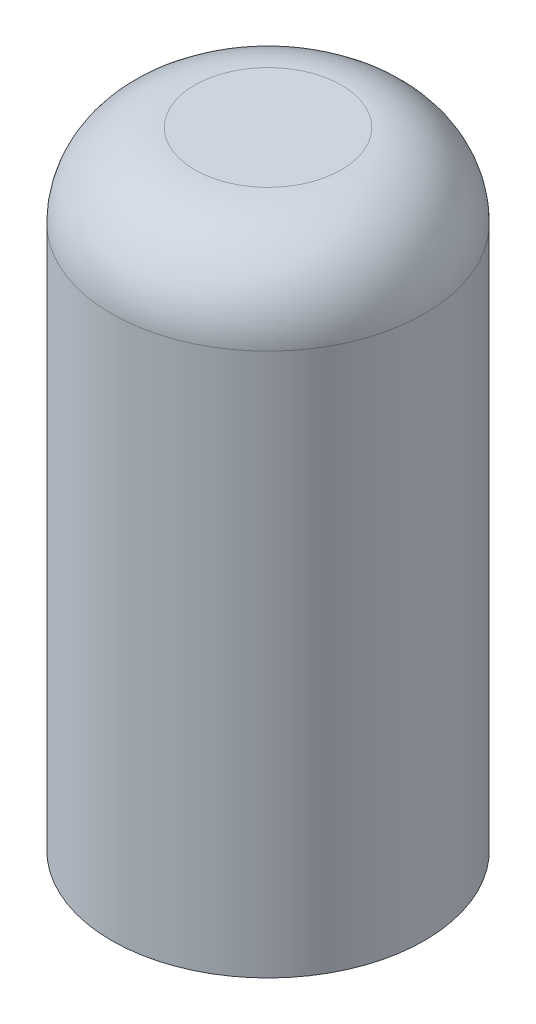
ISO-10303-21;
HEADER;
FILE_DESCRIPTION(('STEP AP214'),'2;1');
FILE_NAME('part.step','',(''),(''),'','','');
FILE_SCHEMA(('AUTOMOTIVE_DESIGN { 1 0 10303 214 1 1 1 1 }'));
ENDSEC;
DATA;
#1=APPLICATION_CONTEXT('core data for automotive mechanical design processes');
#2=APPLICATION_PROTOCOL_DEFINITION('international standard','automotive_design',2000,#1);
#3=PRODUCT_CONTEXT('',#1,'mechanical');
#4=PRODUCT('Part','Part','',(#3));
#5=PRODUCT_RELATED_PRODUCT_CATEGORY('part','',(#4));
#6=PRODUCT_DEFINITION_FORMATION('','',#4);
#7=PRODUCT_DEFINITION_CONTEXT('part definition',#1,'design');
#8=PRODUCT_DEFINITION('design','',#6,#7);
#9=PRODUCT_DEFINITION_SHAPE('','',#8);
#10=(LENGTH_UNIT() NAMED_UNIT(*) SI_UNIT(.MILLI.,.METRE.));
#11=(NAMED_UNIT(*) PLANE_ANGLE_UNIT() SI_UNIT($,.RADIAN.));
#12=(NAMED_UNIT(*) SI_UNIT($,.STERADIAN.) SOLID_ANGLE_UNIT());
#13=UNCERTAINTY_MEASURE_WITH_UNIT(LENGTH_MEASURE(1.E-05),#10,'distance_accuracy_value','');
#14=(GEOMETRIC_REPRESENTATION_CONTEXT(3) GLOBAL_UNCERTAINTY_ASSIGNED_CONTEXT((#13)) GLOBAL_UNIT_ASSIGNED_CONTEXT((#10,
#11,#12)) REPRESENTATION_CONTEXT('',''));
#15=CARTESIAN_POINT('',(0.,0.,0.));
#16=DIRECTION('',(0.,0.,1.));
#17=DIRECTION('',(1.,0.,0.));
#18=AXIS2_PLACEMENT_3D('',#15,#16,#17);
#19=CARTESIAN_POINT('',(0.,226.,0.));
#20=DIRECTION('',(0.,-1.,0.));
#21=DIRECTION('',(0.,0.,-1.));
#22=AXIS2_PLACEMENT_3D('',#19,#20,#21);
#23=CYLINDRICAL_SURFACE('',#22,56.5);
#24=CARTESIAN_POINT('',(0.,196.,0.));
#25=DIRECTION('',(0.,1.,0.));
#26=DIRECTION('',(0.,0.,1.));
#27=AXIS2_PLACEMENT_3D('',#24,#25,#26);
#28=CIRCLE('',#27,56.5);
#29=CARTESIAN_POINT('',(0.,196.,56.5));
#30=VERTEX_POINT('',#29);
#31=EDGE_CURVE('E10',#30,#30,#28,.F.);
#32=ORIENTED_EDGE('',*,*,#31,.T.);
#33=EDGE_LOOP('',(#32));
#34=FACE_BOUND('',#33,.T.);
#35=CARTESIAN_POINT('',(0.,0.,0.));
#36=DIRECTION('',(0.,1.,0.));
#37=DIRECTION('',(0.,0.,1.));
#38=AXIS2_PLACEMENT_3D('',#35,#36,#37);
#39=CIRCLE('',#38,56.5);
#40=CARTESIAN_POINT('',(0.,0.,56.5));
#41=VERTEX_POINT('',#40);
#42=EDGE_CURVE('E52',#41,#41,#39,.T.);
#43=ORIENTED_EDGE('',*,*,#42,.T.);
#44=EDGE_LOOP('',(#43));
#45=FACE_BOUND('',#44,.T.);
#46=ADVANCED_FACE('F41',(#34,#45),#23,.T.);
#47=CARTESIAN_POINT('',(0.,226.,0.));
#48=DIRECTION('',(0.,1.,0.));
#49=DIRECTION('',(0.,0.,1.));
#50=AXIS2_PLACEMENT_3D('',#47,#48,#49);
#51=PLANE('',#50);
#52=CARTESIAN_POINT('',(0.,226.,0.));
#53=DIRECTION('',(0.,1.,0.));
#54=DIRECTION('',(0.,0.,1.));
#55=AXIS2_PLACEMENT_3D('',#52,#53,#54);
#56=CIRCLE('',#55,26.5);
#57=CARTESIAN_POINT('',(0.,226.,26.5));
#58=VERTEX_POINT('',#57);
#59=EDGE_CURVE('E48',#58,#58,#56,.T.);
#60=ORIENTED_EDGE('',*,*,#59,.T.);
#61=EDGE_LOOP('',(#60));
#62=FACE_BOUND('',#61,.T.);
#63=ADVANCED_FACE('F62',(#62),#51,.T.);
#64=CARTESIAN_POINT('',(0.,0.,0.));
#65=DIRECTION('',(0.,1.,0.));
#66=DIRECTION('',(0.,0.,1.));
#67=AXIS2_PLACEMENT_3D('',#64,#65,#66);
#68=PLANE('',#67);
#69=ORIENTED_EDGE('',*,*,#42,.F.);
#70=EDGE_LOOP('',(#69));
#71=FACE_BOUND('',#70,.T.);
#72=ADVANCED_FACE('F60',(#71),#68,.F.);
#73=CARTESIAN_POINT('',(0.,196.,0.));
#74=DIRECTION('',(0.,1.,0.));
#75=DIRECTION('',(0.,0.,1.));
#76=AXIS2_PLACEMENT_3D('',#73,#74,#75);
#77=DEGENERATE_TOROIDAL_SURFACE('',#76,26.5,30.,.T.);
#78=ORIENTED_EDGE('',*,*,#31,.F.);
#79=EDGE_LOOP('',(#78));
#80=FACE_BOUND('',#79,.T.);
#81=ORIENTED_EDGE('',*,*,#59,.F.);
#82=EDGE_LOOP('',(#81));
#83=FACE_BOUND('',#82,.T.);
#84=ADVANCED_FACE('F43',(#80,#83),#77,.T.);
#85=CLOSED_SHELL('',(#46,#63,#72,#84));
#86=MANIFOLD_SOLID_BREP('B2',#85);
#87=ADVANCED_BREP_SHAPE_REPRESENTATION('',(#18,#86),#14);
#88=SHAPE_DEFINITION_REPRESENTATION(#9,#87);
ENDSEC;
END-ISO-10303-21;
